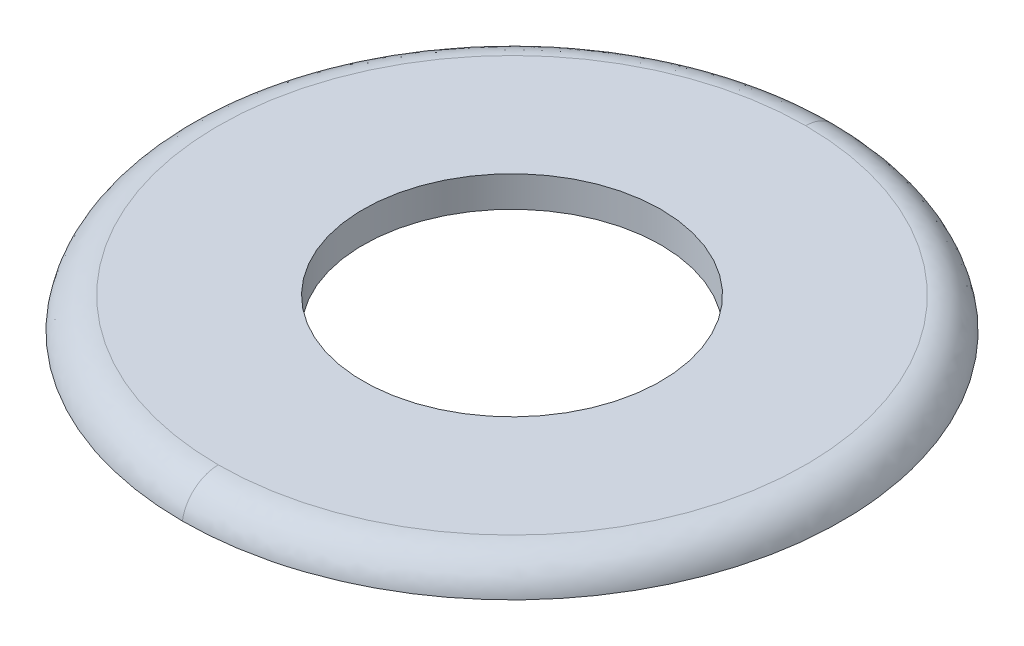
ISO-10303-21;
HEADER;
FILE_DESCRIPTION(('STEP AP214'),'2;1');
FILE_NAME('part.step','',(''),(''),'','','');
FILE_SCHEMA(('AUTOMOTIVE_DESIGN { 1 0 10303 214 1 1 1 1 }'));
ENDSEC;
DATA;
#1=APPLICATION_CONTEXT('core data for automotive mechanical design processes');
#2=APPLICATION_PROTOCOL_DEFINITION('international standard','automotive_design',2000,#1);
#3=PRODUCT_CONTEXT('',#1,'mechanical');
#4=PRODUCT('Part','Part','',(#3));
#5=PRODUCT_RELATED_PRODUCT_CATEGORY('part','',(#4));
#6=PRODUCT_DEFINITION_FORMATION('','',#4);
#7=PRODUCT_DEFINITION_CONTEXT('part definition',#1,'design');
#8=PRODUCT_DEFINITION('design','',#6,#7);
#9=PRODUCT_DEFINITION_SHAPE('','',#8);
#10=(LENGTH_UNIT() NAMED_UNIT(*) SI_UNIT(.MILLI.,.METRE.));
#11=(NAMED_UNIT(*) PLANE_ANGLE_UNIT() SI_UNIT($,.RADIAN.));
#12=(NAMED_UNIT(*) SI_UNIT($,.STERADIAN.) SOLID_ANGLE_UNIT());
#13=UNCERTAINTY_MEASURE_WITH_UNIT(LENGTH_MEASURE(1.E-05),#10,'distance_accuracy_value','');
#14=(GEOMETRIC_REPRESENTATION_CONTEXT(3) GLOBAL_UNCERTAINTY_ASSIGNED_CONTEXT((#13)) GLOBAL_UNIT_ASSIGNED_CONTEXT((#10,
#11,#12)) REPRESENTATION_CONTEXT('',''));
#15=CARTESIAN_POINT('',(0.,0.,0.));
#16=DIRECTION('',(0.,0.,1.));
#17=DIRECTION('',(1.,0.,0.));
#18=AXIS2_PLACEMENT_3D('',#15,#16,#17);
#19=CARTESIAN_POINT('',(0.,3.714220833,-4.528047654));
#20=CARTESIAN_POINT('',(9.056095308,3.714220833,-4.528047654));
#21=CARTESIAN_POINT('',(9.056095308,3.714220833,4.528047654));
#22=CARTESIAN_POINT('',(0.,3.714220833,4.528047654));
#23=CARTESIAN_POINT('',(0.,3.969136114,-4.488659085));
#24=CARTESIAN_POINT('',(8.977318171,3.969136114,-4.488659085));
#25=CARTESIAN_POINT('',(8.977318171,3.969136114,4.488659085));
#26=CARTESIAN_POINT('',(0.,3.969136114,4.488659085));
#27=CARTESIAN_POINT('',(0.,4.137025,-4.292836252));
#28=CARTESIAN_POINT('',(8.585672505,4.137025,-4.292836252));
#29=CARTESIAN_POINT('',(8.585672505,4.137025,4.292836252));
#30=CARTESIAN_POINT('',(0.,4.137025,4.292836252));
#31=CARTESIAN_POINT('',(0.,4.137025,-4.034895833));
#32=CARTESIAN_POINT('',(8.069791667,4.137025,-4.034895833));
#33=CARTESIAN_POINT('',(8.069791667,4.137025,4.034895833));
#34=CARTESIAN_POINT('',(0.,4.137025,4.034895833));
#35=(BOUNDED_SURFACE() B_SPLINE_SURFACE(3,3,((#19,#20,#21,#22),(#23,#24,#25,#26),(#27,#28,#29,
#30),(#31,#32,#33,#34)),.UNSPECIFIED.,.F.,.F.,.F.) B_SPLINE_SURFACE_WITH_KNOTS((4,4),(4,4),(0.,
1.),(0.,1.),.UNSPECIFIED.) GEOMETRIC_REPRESENTATION_ITEM() RATIONAL_B_SPLINE_SURFACE(((1.,
0.333333333333333,0.333333333333333,1.),(0.839452365388269,0.279817455129423,0.279817455129423,
0.839452365388269),(0.839452365388269,0.279817455129423,0.279817455129423,0.839452365388269),
(1.,0.333333333333333,0.333333333333333,1.))) REPRESENTATION_ITEM('') SURFACE());
#36=CARTESIAN_POINT('',(0.,3.714220833,-4.528047654));
#37=CARTESIAN_POINT('',(0.,3.969136114,-4.488659085));
#38=CARTESIAN_POINT('',(0.,4.137025,-4.292836252));
#39=CARTESIAN_POINT('',(0.,4.137025,-4.034895833));
#40=(BOUNDED_CURVE() B_SPLINE_CURVE(3,(#36,#37,#38,#39),.UNSPECIFIED.,.F.,
.F.) B_SPLINE_CURVE_WITH_KNOTS((4,4),(0.,1.),
.UNSPECIFIED.) CURVE() GEOMETRIC_REPRESENTATION_ITEM() RATIONAL_B_SPLINE_CURVE((1.,
0.839452365388269,0.839452365388269,1.)) REPRESENTATION_ITEM(''));
#41=CARTESIAN_POINT('',(0.,3.714220833,-4.528047654));
#42=VERTEX_POINT('',#41);
#43=CARTESIAN_POINT('',(0.,4.137025,-4.03489583220106));
#44=VERTEX_POINT('',#43);
#45=EDGE_CURVE('E40',#42,#44,#40,.T.);
#46=CARTESIAN_POINT('',(0.,4.137025,-4.034895833));
#47=CARTESIAN_POINT('',(8.069791667,4.137025,-4.034895833));
#48=CARTESIAN_POINT('',(8.069791667,4.137025,4.034895833));
#49=CARTESIAN_POINT('',(0.,4.137025,4.034895833));
#50=(BOUNDED_CURVE() B_SPLINE_CURVE(3,(#46,#47,#48,#49),.UNSPECIFIED.,.F.,
.F.) B_SPLINE_CURVE_WITH_KNOTS((4,4),(0.,1.),
.UNSPECIFIED.) CURVE() GEOMETRIC_REPRESENTATION_ITEM() RATIONAL_B_SPLINE_CURVE((1.,
0.333333333333333,0.333333333333333,1.)) REPRESENTATION_ITEM(''));
#51=CARTESIAN_POINT('',(0.,4.137025,4.03489583220106));
#52=VERTEX_POINT('',#51);
#53=EDGE_CURVE('E51',#52,#44,#50,.F.);
#54=CARTESIAN_POINT('',(0.,3.714220833,4.528047654));
#55=CARTESIAN_POINT('',(0.,3.969136114,4.488659085));
#56=CARTESIAN_POINT('',(0.,4.137025,4.292836252));
#57=CARTESIAN_POINT('',(0.,4.137025,4.034895833));
#58=(BOUNDED_CURVE() B_SPLINE_CURVE(3,(#54,#55,#56,#57),.UNSPECIFIED.,.F.,
.F.) B_SPLINE_CURVE_WITH_KNOTS((4,4),(0.,1.),
.UNSPECIFIED.) CURVE() GEOMETRIC_REPRESENTATION_ITEM() RATIONAL_B_SPLINE_CURVE((1.,
0.839452365388269,0.839452365388269,1.)) REPRESENTATION_ITEM(''));
#59=CARTESIAN_POINT('',(0.,3.714220833,4.528047654));
#60=VERTEX_POINT('',#59);
#61=EDGE_CURVE('E48',#52,#60,#58,.F.);
#62=CARTESIAN_POINT('',(0.,3.714220833,-4.528047654));
#63=CARTESIAN_POINT('',(0.167636832813959,3.714220833,-4.5280695009264));
#64=CARTESIAN_POINT('',(0.335198533223778,3.714220833,-4.51873564249962));
#65=CARTESIAN_POINT('',(0.668508865638245,3.714220833,-4.48156622123749));
#66=CARTESIAN_POINT('',(0.834254447295548,3.714220833,-4.45370329649287));
#67=CARTESIAN_POINT('',(1.24619028492255,3.714220833,-4.360606059931));
#68=CARTESIAN_POINT('',(1.48979735026006,3.714220833,-4.2835104156951));
#69=CARTESIAN_POINT('',(1.96064869895165,3.714220833,-4.08949886216297));
#70=CARTESIAN_POINT('',(2.18788461079086,3.714220833,-3.97256275278782));
#71=CARTESIAN_POINT('',(2.61946514355458,3.714220833,-3.70221741232022));
#72=CARTESIAN_POINT('',(2.8238151120266,3.714220833,-3.54881672783679));
#73=CARTESIAN_POINT('',(3.2038465765749,3.714220833,-3.20989297111489));
#74=CARTESIAN_POINT('',(3.37952919702094,3.714220833,-3.02437115929629));
#75=CARTESIAN_POINT('',(3.69726133437401,3.714220833,-2.62646046111252));
#76=CARTESIAN_POINT('',(3.83930989107149,3.714220833,-2.41407080797032));
#77=CARTESIAN_POINT('',(4.08573064444436,3.714220833,-1.96846210553937));
#78=CARTESIAN_POINT('',(4.19010351389178,3.714220833,-1.73524342828579));
#79=CARTESIAN_POINT('',(4.35821434943049,3.714220833,-1.25459334571783));
#80=CARTESIAN_POINT('',(4.42195226905235,3.714220833,-1.00716192415037));
#81=CARTESIAN_POINT('',(4.50698420929923,3.714220833,-0.505106436015935));
#82=CARTESIAN_POINT('',(4.52827756901687,3.714220833,-0.25048225751263));
#83=CARTESIAN_POINT('',(4.52781398604484,3.714220833,0.258726887245589));
#84=CARTESIAN_POINT('',(4.50605704660732,3.714220833,0.513311853503465));
#85=CARTESIAN_POINT('',(4.4201111133984,3.714220833,1.01521168471811));
#86=CARTESIAN_POINT('',(4.35592277391848,3.714220833,1.26252666171657));
#87=CARTESIAN_POINT('',(4.18693701002419,3.714220833,1.74286997424917));
#88=CARTESIAN_POINT('',(4.08213961759587,3.714220833,1.97589832103613));
#89=CARTESIAN_POINT('',(3.83490787381612,3.714220833,2.42105758575796));
#90=CARTESIAN_POINT('',(3.69247288284773,3.714220833,2.63318814846977));
#91=CARTESIAN_POINT('',(3.37401712955591,3.714220833,3.03051921791546));
#92=CARTESIAN_POINT('',(3.19799737173,3.714220833,3.21572052979303));
#93=CARTESIAN_POINT('',(2.81734947057684,3.714220833,3.55395188426249));
#94=CARTESIAN_POINT('',(2.61272010268588,3.714220833,3.70698054908133));
#95=CARTESIAN_POINT('',(2.18064644583674,3.714220833,3.97654073841861));
#96=CARTESIAN_POINT('',(1.95319671564756,3.714220833,4.09306353113227));
#97=CARTESIAN_POINT('',(1.48199184752025,3.714220833,4.28621697764519));
#98=CARTESIAN_POINT('',(1.23824526153149,3.714220833,4.36286837182186));
#99=CARTESIAN_POINT('',(0.827484146727239,3.714220833,4.4549147143649));
#100=CARTESIAN_POINT('',(0.66306177876278,3.714220833,4.48232450058158));
#101=CARTESIAN_POINT('',(0.33244921051866,3.714220833,4.51888764331797));
#102=CARTESIAN_POINT('',(0.166262023999411,3.714220833,4.52806825898662));
#103=CARTESIAN_POINT('',(0.,3.714220833,4.528047654));
#104=B_SPLINE_CURVE_WITH_KNOTS('',3,(#62,#63,#64,#65,#66,#67,#68,#69,#70,#71,#72,#73,#74,#75,
#76,#77,#78,#79,#80,#81,#82,#83,#84,#85,#86,#87,#88,#89,#90,#91,#92,#93,#94,#95,#96,#97,#98,#99,
#100,#101,#102,#103),.UNSPECIFIED.,.F.,.F.,(4,2,2,2,2,2,2,2,2,2,2,2,2,2,2,2,2,2,2,2,4),(0.,
0.502504648367174,1.00575299903442,1.76846564342436,2.5315655784842,3.29448683335135,
4.05737815828319,4.82029126016271,5.58319073808385,6.34609108844194,7.10900331788461,
7.87191548969437,8.63481589768538,9.39771570477261,10.1606284774861,10.9235184355739,
11.6864410572847,12.449546022657,13.2122536367157,13.7113875937276,14.2097746026379),.UNSPECIFIED.);
#105=EDGE_CURVE('E22',#42,#60,#104,.T.);
#106=ORIENTED_EDGE('',*,*,#45,.T.);
#107=ORIENTED_EDGE('',*,*,#53,.F.);
#108=ORIENTED_EDGE('',*,*,#61,.T.);
#109=ORIENTED_EDGE('',*,*,#105,.F.);
#110=EDGE_LOOP('',(#106,#107,#108,#109));
#111=FACE_BOUND('',#110,.T.);
#112=ADVANCED_FACE('F17',(#111),#35,.T.);
#113=CARTESIAN_POINT('',(0.,4.137025,0.));
#114=DIRECTION('',(0.,-1.,0.));
#115=DIRECTION('',(0.,0.,-1.));
#116=AXIS2_PLACEMENT_3D('',#113,#114,#115);
#117=CYLINDRICAL_SURFACE('',#116,2.045424837);
#118=CARTESIAN_POINT('',(0.,3.714220833,0.));
#119=DIRECTION('',(0.,-1.,0.));
#120=DIRECTION('',(0.,0.,-1.));
#121=AXIS2_PLACEMENT_3D('',#118,#119,#120);
#122=CIRCLE('',#121,2.045424837);
#123=CARTESIAN_POINT('',(0.,3.714220833,-2.045424837));
#124=VERTEX_POINT('',#123);
#125=EDGE_CURVE('E57',#124,#124,#122,.F.);
#126=ORIENTED_EDGE('',*,*,#125,.F.);
#127=EDGE_LOOP('',(#126));
#128=FACE_BOUND('',#127,.T.);
#129=CARTESIAN_POINT('',(0.,4.137025,0.));
#130=DIRECTION('',(0.,-1.,0.));
#131=DIRECTION('',(0.,0.,-1.));
#132=AXIS2_PLACEMENT_3D('',#129,#130,#131);
#133=CIRCLE('',#132,2.045424837);
#134=CARTESIAN_POINT('',(0.,4.137025,-2.045424837));
#135=VERTEX_POINT('',#134);
#136=EDGE_CURVE('E59',#135,#135,#133,.T.);
#137=ORIENTED_EDGE('',*,*,#136,.F.);
#138=EDGE_LOOP('',(#137));
#139=FACE_BOUND('',#138,.T.);
#140=ADVANCED_FACE('F77',(#128,#139),#117,.F.);
#141=CARTESIAN_POINT('',(-4.582384226,3.714220833,4.582384226));
#142=DIRECTION('',(0.,-1.,0.));
#143=DIRECTION('',(0.,0.,-1.));
#144=AXIS2_PLACEMENT_3D('',#141,#142,#143);
#145=PLANE('',#144);
#146=ORIENTED_EDGE('',*,*,#125,.T.);
#147=EDGE_LOOP('',(#146));
#148=FACE_BOUND('',#147,.T.);
#149=ORIENTED_EDGE('',*,*,#105,.T.);
#150=CARTESIAN_POINT('',(0.,3.714220833,-4.528047654));
#151=CARTESIAN_POINT('',(-0.16763683281396,3.714220833,-4.5280695009264));
#152=CARTESIAN_POINT('',(-0.335198533223779,3.714220833,-4.51873564249962));
#153=CARTESIAN_POINT('',(-0.668508865638246,3.714220833,-4.48156622123749));
#154=CARTESIAN_POINT('',(-0.834254447295549,3.714220833,-4.45370329649287));
#155=CARTESIAN_POINT('',(-1.24619028492255,3.714220833,-4.360606059931));
#156=CARTESIAN_POINT('',(-1.48979735026007,3.714220833,-4.2835104156951));
#157=CARTESIAN_POINT('',(-1.96064869895166,3.714220833,-4.08949886216296));
#158=CARTESIAN_POINT('',(-2.18788461079087,3.714220833,-3.97256275278782));
#159=CARTESIAN_POINT('',(-2.61946514355458,3.714220833,-3.70221741232022));
#160=CARTESIAN_POINT('',(-2.8238151120266,3.714220833,-3.54881672783679));
#161=CARTESIAN_POINT('',(-3.20384657657491,3.714220833,-3.20989297111489));
#162=CARTESIAN_POINT('',(-3.37952919702094,3.714220833,-3.02437115929628));
#163=CARTESIAN_POINT('',(-3.69726133437402,3.714220833,-2.62646046111252));
#164=CARTESIAN_POINT('',(-3.8393098910715,3.714220833,-2.41407080797031));
#165=CARTESIAN_POINT('',(-4.08573064444436,3.714220833,-1.96846210553937));
#166=CARTESIAN_POINT('',(-4.19010351389178,3.714220833,-1.73524342828578));
#167=CARTESIAN_POINT('',(-4.35821434943049,3.714220833,-1.25459334571783));
#168=CARTESIAN_POINT('',(-4.42195226905235,3.714220833,-1.00716192415037));
#169=CARTESIAN_POINT('',(-4.50698420929923,3.714220833,-0.505106436015934));
#170=CARTESIAN_POINT('',(-4.52827756901687,3.714220833,-0.250482257512629));
#171=CARTESIAN_POINT('',(-4.52781398604484,3.714220833,0.25872688724559));
#172=CARTESIAN_POINT('',(-4.50605704660732,3.714220833,0.513311853503466));
#173=CARTESIAN_POINT('',(-4.4201111133984,3.714220833,1.01521168471811));
#174=CARTESIAN_POINT('',(-4.35592277391848,3.714220833,1.26252666171657));
#175=CARTESIAN_POINT('',(-4.18693701002419,3.714220833,1.74286997424917));
#176=CARTESIAN_POINT('',(-4.08213961759587,3.714220833,1.97589832103613));
#177=CARTESIAN_POINT('',(-3.83490787381612,3.714220833,2.42105758575796));
#178=CARTESIAN_POINT('',(-3.69247288284773,3.714220833,2.63318814846978));
#179=CARTESIAN_POINT('',(-3.37401712955591,3.714220833,3.03051921791546));
#180=CARTESIAN_POINT('',(-3.19799737173,3.714220833,3.21572052979303));
#181=CARTESIAN_POINT('',(-2.81734947057683,3.714220833,3.55395188426249));
#182=CARTESIAN_POINT('',(-2.61272010268588,3.714220833,3.70698054908133));
#183=CARTESIAN_POINT('',(-2.18064644583674,3.714220833,3.97654073841861));
#184=CARTESIAN_POINT('',(-1.95319671564756,3.714220833,4.09306353113228));
#185=CARTESIAN_POINT('',(-1.48199184752025,3.714220833,4.28621697764519));
#186=CARTESIAN_POINT('',(-1.23824526153149,3.714220833,4.36286837182186));
#187=CARTESIAN_POINT('',(-0.827484146727237,3.714220833,4.4549147143649));
#188=CARTESIAN_POINT('',(-0.663061778762778,3.714220833,4.48232450058158));
#189=CARTESIAN_POINT('',(-0.33244921051866,3.714220833,4.51888764331797));
#190=CARTESIAN_POINT('',(-0.166262023999411,3.714220833,4.52806825898662));
#191=CARTESIAN_POINT('',(0.,3.714220833,4.528047654));
#192=B_SPLINE_CURVE_WITH_KNOTS('',3,(#150,#151,#152,#153,#154,#155,#156,#157,#158,#159,#160,
#161,#162,#163,#164,#165,#166,#167,#168,#169,#170,#171,#172,#173,#174,#175,#176,#177,#178,#179,
#180,#181,#182,#183,#184,#185,#186,#187,#188,#189,#190,#191),.UNSPECIFIED.,.F.,.F.,(4,2,2,2,2,2,
2,2,2,2,2,2,2,2,2,2,2,2,2,2,4),(0.,0.502504648367175,1.00575299903442,1.76846564342436,
2.5315655784842,3.29448683335136,4.05737815828319,4.82029126016271,5.58319073808385,
6.34609108844194,7.10900331788461,7.87191548969437,8.63481589768538,9.39771570477261,
10.1606284774861,10.9235184355739,11.6864410572847,12.449546022657,13.2122536367157,
13.7113875937276,14.2097746026379),.UNSPECIFIED.);
#193=EDGE_CURVE('E32',#42,#60,#192,.T.);
#194=ORIENTED_EDGE('',*,*,#193,.F.);
#195=EDGE_LOOP('',(#149,#194));
#196=FACE_BOUND('',#195,.T.);
#197=ADVANCED_FACE('F56',(#148,#196),#145,.T.);
#198=CARTESIAN_POINT('',(-4.083363831,4.137025,-4.083314583));
#199=DIRECTION('',(0.,1.,0.));
#200=DIRECTION('',(0.,0.,1.));
#201=AXIS2_PLACEMENT_3D('',#198,#199,#200);
#202=PLANE('',#201);
#203=ORIENTED_EDGE('',*,*,#136,.T.);
#204=EDGE_LOOP('',(#203));
#205=FACE_BOUND('',#204,.T.);
#206=CARTESIAN_POINT('',(0.,4.137025,4.034895833));
#207=CARTESIAN_POINT('',(-8.069791667,4.137025,4.034895833));
#208=CARTESIAN_POINT('',(-8.069791667,4.137025,-4.034895833));
#209=CARTESIAN_POINT('',(0.,4.137025,-4.034895833));
#210=(BOUNDED_CURVE() B_SPLINE_CURVE(3,(#206,#207,#208,#209),.UNSPECIFIED.,.F.,
.F.) B_SPLINE_CURVE_WITH_KNOTS((4,4),(0.,1.),
.UNSPECIFIED.) CURVE() GEOMETRIC_REPRESENTATION_ITEM() RATIONAL_B_SPLINE_CURVE((1.,
0.333333333333333,0.333333333333333,1.)) REPRESENTATION_ITEM(''));
#211=EDGE_CURVE('E11',#52,#44,#210,.T.);
#212=ORIENTED_EDGE('',*,*,#211,.F.);
#213=ORIENTED_EDGE('',*,*,#53,.T.);
#214=EDGE_LOOP('',(#212,#213));
#215=FACE_BOUND('',#214,.T.);
#216=ADVANCED_FACE('F19',(#205,#215),#202,.T.);
#217=CARTESIAN_POINT('',(0.,3.714220833,4.528047654));
#218=CARTESIAN_POINT('',(-9.056095308,3.714220833,4.528047654));
#219=CARTESIAN_POINT('',(-9.056095308,3.714220833,-4.528047654));
#220=CARTESIAN_POINT('',(0.,3.714220833,-4.528047654));
#221=CARTESIAN_POINT('',(0.,3.969136114,4.488659085));
#222=CARTESIAN_POINT('',(-8.977318171,3.969136114,4.488659085));
#223=CARTESIAN_POINT('',(-8.977318171,3.969136114,-4.488659085));
#224=CARTESIAN_POINT('',(0.,3.969136114,-4.488659085));
#225=CARTESIAN_POINT('',(0.,4.137025,4.292836252));
#226=CARTESIAN_POINT('',(-8.585672505,4.137025,4.292836252));
#227=CARTESIAN_POINT('',(-8.585672505,4.137025,-4.292836252));
#228=CARTESIAN_POINT('',(0.,4.137025,-4.292836252));
#229=CARTESIAN_POINT('',(0.,4.137025,4.034895833));
#230=CARTESIAN_POINT('',(-8.069791667,4.137025,4.034895833));
#231=CARTESIAN_POINT('',(-8.069791667,4.137025,-4.034895833));
#232=CARTESIAN_POINT('',(0.,4.137025,-4.034895833));
#233=(BOUNDED_SURFACE() B_SPLINE_SURFACE(3,3,((#217,#218,#219,#220),(#221,#222,#223,#224),(#225,
#226,#227,#228),(#229,#230,#231,#232)),.UNSPECIFIED.,.F.,.F.,
.F.) B_SPLINE_SURFACE_WITH_KNOTS((4,4),(4,4),(0.,1.),(0.,1.),
.UNSPECIFIED.) GEOMETRIC_REPRESENTATION_ITEM() RATIONAL_B_SPLINE_SURFACE(((1.,0.333333333333333,
0.333333333333333,1.),(0.839452365388269,0.279817455129423,0.279817455129423,0.839452365388269),
(0.839452365388269,0.279817455129423,0.279817455129423,0.839452365388269),(1.,0.333333333333333,
0.333333333333333,1.))) REPRESENTATION_ITEM('') SURFACE());
#234=ORIENTED_EDGE('',*,*,#211,.T.);
#235=ORIENTED_EDGE('',*,*,#45,.F.);
#236=ORIENTED_EDGE('',*,*,#193,.T.);
#237=ORIENTED_EDGE('',*,*,#61,.F.);
#238=EDGE_LOOP('',(#234,#235,#236,#237));
#239=FACE_BOUND('',#238,.T.);
#240=ADVANCED_FACE('F58',(#239),#233,.T.);
#241=CLOSED_SHELL('',(#112,#140,#197,#216,#240));
#242=MANIFOLD_SOLID_BREP('B1',#241);
#243=ADVANCED_BREP_SHAPE_REPRESENTATION('',(#18,#242),#14);
#244=SHAPE_DEFINITION_REPRESENTATION(#9,#243);
ENDSEC;
END-ISO-10303-21;
